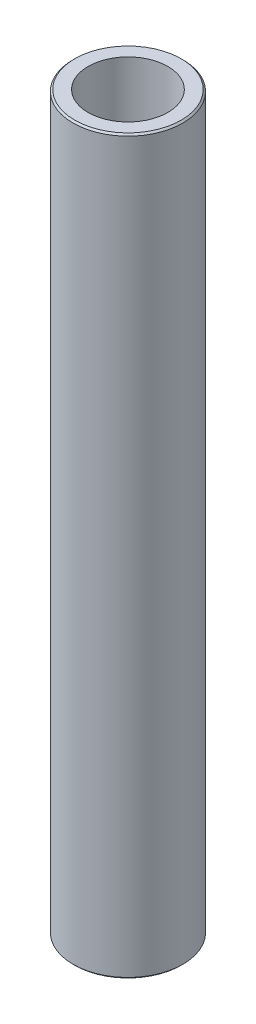
ISO-10303-21;
HEADER;
FILE_DESCRIPTION(('STEP AP214'),'2;1');
FILE_NAME('part.step','',(''),(''),'','','');
FILE_SCHEMA(('AUTOMOTIVE_DESIGN { 1 0 10303 214 1 1 1 1 }'));
ENDSEC;
DATA;
#1=APPLICATION_CONTEXT('core data for automotive mechanical design processes');
#2=APPLICATION_PROTOCOL_DEFINITION('international standard','automotive_design',2000,#1);
#3=PRODUCT_CONTEXT('',#1,'mechanical');
#4=PRODUCT('Part','Part','',(#3));
#5=PRODUCT_RELATED_PRODUCT_CATEGORY('part','',(#4));
#6=PRODUCT_DEFINITION_FORMATION('','',#4);
#7=PRODUCT_DEFINITION_CONTEXT('part definition',#1,'design');
#8=PRODUCT_DEFINITION('design','',#6,#7);
#9=PRODUCT_DEFINITION_SHAPE('','',#8);
#10=(LENGTH_UNIT() NAMED_UNIT(*) SI_UNIT(.MILLI.,.METRE.));
#11=(NAMED_UNIT(*) PLANE_ANGLE_UNIT() SI_UNIT($,.RADIAN.));
#12=(NAMED_UNIT(*) SI_UNIT($,.STERADIAN.) SOLID_ANGLE_UNIT());
#13=UNCERTAINTY_MEASURE_WITH_UNIT(LENGTH_MEASURE(1.E-05),#10,'distance_accuracy_value','');
#14=(GEOMETRIC_REPRESENTATION_CONTEXT(3) GLOBAL_UNCERTAINTY_ASSIGNED_CONTEXT((#13)) GLOBAL_UNIT_ASSIGNED_CONTEXT((#10,
#11,#12)) REPRESENTATION_CONTEXT('',''));
#15=CARTESIAN_POINT('',(0.,0.,0.));
#16=DIRECTION('',(0.,0.,1.));
#17=DIRECTION('',(1.,0.,0.));
#18=AXIS2_PLACEMENT_3D('',#15,#16,#17);
#19=CARTESIAN_POINT('',(0.,600.,0.));
#20=DIRECTION('',(0.,-1.,0.));
#21=DIRECTION('',(0.,0.,-1.));
#22=AXIS2_PLACEMENT_3D('',#19,#20,#21);
#23=CYLINDRICAL_SURFACE('',#22,45.);
#24=CARTESIAN_POINT('',(0.,598.62879582418,0.));
#25=DIRECTION('',(0.,1.,0.));
#26=DIRECTION('',(0.,0.,1.));
#27=AXIS2_PLACEMENT_3D('',#24,#25,#26);
#28=CIRCLE('',#27,45.);
#29=CARTESIAN_POINT('',(0.,598.62879582418,45.));
#30=VERTEX_POINT('',#29);
#31=EDGE_CURVE('E50',#30,#30,#28,.F.);
#32=ORIENTED_EDGE('',*,*,#31,.T.);
#33=EDGE_LOOP('',(#32));
#34=FACE_BOUND('',#33,.T.);
#35=CARTESIAN_POINT('',(0.,1.37120417581982,0.));
#36=DIRECTION('',(0.,1.,0.));
#37=DIRECTION('',(0.,0.,1.));
#38=AXIS2_PLACEMENT_3D('',#35,#36,#37);
#39=CIRCLE('',#38,45.);
#40=CARTESIAN_POINT('',(0.,1.37120417581982,45.));
#41=VERTEX_POINT('',#40);
#42=EDGE_CURVE('E51',#41,#41,#39,.T.);
#43=ORIENTED_EDGE('',*,*,#42,.T.);
#44=EDGE_LOOP('',(#43));
#45=FACE_BOUND('',#44,.T.);
#46=ADVANCED_FACE('F39',(#34,#45),#23,.T.);
#47=CARTESIAN_POINT('',(0.,600.,0.));
#48=DIRECTION('',(0.,1.,0.));
#49=DIRECTION('',(0.,0.,1.));
#50=AXIS2_PLACEMENT_3D('',#47,#48,#49);
#51=PLANE('',#50);
#52=CARTESIAN_POINT('',(0.,600.,0.));
#53=DIRECTION('',(0.,1.,0.));
#54=DIRECTION('',(0.,0.,1.));
#55=AXIS2_PLACEMENT_3D('',#52,#53,#54);
#56=CIRCLE('',#55,43.6287958241802);
#57=CARTESIAN_POINT('',(0.,600.,43.6287958241802));
#58=VERTEX_POINT('',#57);
#59=EDGE_CURVE('E54',#58,#58,#56,.T.);
#60=ORIENTED_EDGE('',*,*,#59,.T.);
#61=EDGE_LOOP('',(#60));
#62=FACE_BOUND('',#61,.T.);
#63=CARTESIAN_POINT('',(0.,600.,0.));
#64=DIRECTION('',(0.,1.,0.));
#65=DIRECTION('',(0.,0.,1.));
#66=AXIS2_PLACEMENT_3D('',#63,#64,#65);
#67=CIRCLE('',#66,32.7033604018274);
#68=CARTESIAN_POINT('',(0.,600.,32.7033604018274));
#69=VERTEX_POINT('',#68);
#70=EDGE_CURVE('E58',#69,#69,#67,.T.);
#71=ORIENTED_EDGE('',*,*,#70,.F.);
#72=EDGE_LOOP('',(#71));
#73=FACE_BOUND('',#72,.T.);
#74=ADVANCED_FACE('F69',(#62,#73),#51,.T.);
#75=CARTESIAN_POINT('',(0.,0.,0.));
#76=DIRECTION('',(0.,1.,0.));
#77=DIRECTION('',(0.,0.,1.));
#78=AXIS2_PLACEMENT_3D('',#75,#76,#77);
#79=PLANE('',#78);
#80=CARTESIAN_POINT('',(0.,0.,0.));
#81=DIRECTION('',(0.,1.,0.));
#82=DIRECTION('',(0.,0.,1.));
#83=AXIS2_PLACEMENT_3D('',#80,#81,#82);
#84=CIRCLE('',#83,43.6287958241802);
#85=CARTESIAN_POINT('',(0.,0.,43.6287958241802));
#86=VERTEX_POINT('',#85);
#87=EDGE_CURVE('E10',#86,#86,#84,.F.);
#88=ORIENTED_EDGE('',*,*,#87,.T.);
#89=EDGE_LOOP('',(#88));
#90=FACE_BOUND('',#89,.T.);
#91=CARTESIAN_POINT('',(0.,0.,0.));
#92=DIRECTION('',(0.,1.,0.));
#93=DIRECTION('',(0.,0.,1.));
#94=AXIS2_PLACEMENT_3D('',#91,#92,#93);
#95=CIRCLE('',#94,32.7033604018274);
#96=CARTESIAN_POINT('',(0.,0.,32.7033604018274));
#97=VERTEX_POINT('',#96);
#98=EDGE_CURVE('E63',#97,#97,#95,.T.);
#99=ORIENTED_EDGE('',*,*,#98,.T.);
#100=EDGE_LOOP('',(#99));
#101=FACE_BOUND('',#100,.T.);
#102=ADVANCED_FACE('F75',(#90,#101),#79,.F.);
#103=CARTESIAN_POINT('',(0.,600.,0.));
#104=DIRECTION('',(0.,-1.,0.));
#105=DIRECTION('',(0.,0.,-1.));
#106=AXIS2_PLACEMENT_3D('',#103,#104,#105);
#107=CYLINDRICAL_SURFACE('',#106,32.7033604018274);
#108=ORIENTED_EDGE('',*,*,#70,.T.);
#109=EDGE_LOOP('',(#108));
#110=FACE_BOUND('',#109,.T.);
#111=ORIENTED_EDGE('',*,*,#98,.F.);
#112=EDGE_LOOP('',(#111));
#113=FACE_BOUND('',#112,.T.);
#114=ADVANCED_FACE('F70',(#110,#113),#107,.F.);
#115=CARTESIAN_POINT('',(0.,600.,0.));
#116=DIRECTION('',(0.,-1.,0.));
#117=DIRECTION('',(0.,0.,-1.));
#118=AXIS2_PLACEMENT_3D('',#115,#116,#117);
#119=CONICAL_SURFACE('',#118,43.6287958241802,0.785398163397456);
#120=ORIENTED_EDGE('',*,*,#31,.F.);
#121=EDGE_LOOP('',(#120));
#122=FACE_BOUND('',#121,.T.);
#123=ORIENTED_EDGE('',*,*,#59,.F.);
#124=EDGE_LOOP('',(#123));
#125=FACE_BOUND('',#124,.T.);
#126=ADVANCED_FACE('F81',(#122,#125),#119,.T.);
#127=CARTESIAN_POINT('',(0.,1.37120417581982,0.));
#128=DIRECTION('',(0.,1.,0.));
#129=DIRECTION('',(0.,0.,1.));
#130=AXIS2_PLACEMENT_3D('',#127,#128,#129);
#131=CONICAL_SURFACE('',#130,45.,0.785398163397458);
#132=ORIENTED_EDGE('',*,*,#87,.F.);
#133=EDGE_LOOP('',(#132));
#134=FACE_BOUND('',#133,.T.);
#135=ORIENTED_EDGE('',*,*,#42,.F.);
#136=EDGE_LOOP('',(#135));
#137=FACE_BOUND('',#136,.T.);
#138=ADVANCED_FACE('F45',(#134,#137),#131,.T.);
#139=CLOSED_SHELL('',(#46,#74,#102,#114,#126,#138));
#140=MANIFOLD_SOLID_BREP('B2',#139);
#141=ADVANCED_BREP_SHAPE_REPRESENTATION('',(#18,#140),#14);
#142=SHAPE_DEFINITION_REPRESENTATION(#9,#141);
ENDSEC;
END-ISO-10303-21;
